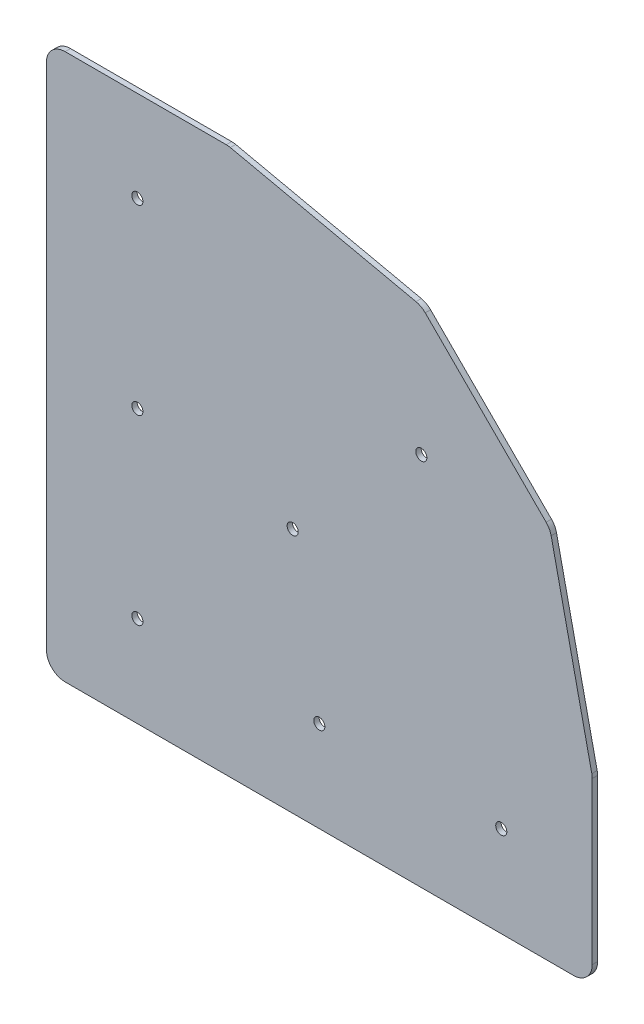
ISO-10303-21;
HEADER;
FILE_DESCRIPTION(('STEP AP214'),'2;1');
FILE_NAME('part.step','',(''),(''),'','','');
FILE_SCHEMA(('AUTOMOTIVE_DESIGN { 1 0 10303 214 1 1 1 1 }'));
ENDSEC;
DATA;
#1=APPLICATION_CONTEXT('core data for automotive mechanical design processes');
#2=APPLICATION_PROTOCOL_DEFINITION('international standard','automotive_design',2000,#1);
#3=PRODUCT_CONTEXT('',#1,'mechanical');
#4=PRODUCT('Part','Part','',(#3));
#5=PRODUCT_RELATED_PRODUCT_CATEGORY('part','',(#4));
#6=PRODUCT_DEFINITION_FORMATION('','',#4);
#7=PRODUCT_DEFINITION_CONTEXT('part definition',#1,'design');
#8=PRODUCT_DEFINITION('design','',#6,#7);
#9=PRODUCT_DEFINITION_SHAPE('','',#8);
#10=(LENGTH_UNIT() NAMED_UNIT(*) SI_UNIT(.MILLI.,.METRE.));
#11=(NAMED_UNIT(*) PLANE_ANGLE_UNIT() SI_UNIT($,.RADIAN.));
#12=(NAMED_UNIT(*) SI_UNIT($,.STERADIAN.) SOLID_ANGLE_UNIT());
#13=UNCERTAINTY_MEASURE_WITH_UNIT(LENGTH_MEASURE(1.E-05),#10,'distance_accuracy_value','');
#14=(GEOMETRIC_REPRESENTATION_CONTEXT(3) GLOBAL_UNCERTAINTY_ASSIGNED_CONTEXT((#13)) GLOBAL_UNIT_ASSIGNED_CONTEXT((#10,
#11,#12)) REPRESENTATION_CONTEXT('',''));
#15=CARTESIAN_POINT('',(0.,0.,0.));
#16=DIRECTION('',(0.,0.,1.));
#17=DIRECTION('',(1.,0.,0.));
#18=AXIS2_PLACEMENT_3D('',#15,#16,#17);
#19=CARTESIAN_POINT('',(156.36875,5.55625,1.5875));
#20=DIRECTION('',(0.,0.,-1.));
#21=DIRECTION('',(-1.,0.,0.));
#22=AXIS2_PLACEMENT_3D('',#19,#20,#21);
#23=CYLINDRICAL_SURFACE('',#22,5.55624999999999);
#24=CARTESIAN_POINT('',(156.36875,5.55625,0.));
#25=DIRECTION('',(0.,0.,-1.));
#26=DIRECTION('',(-1.,0.,0.));
#27=AXIS2_PLACEMENT_3D('',#24,#25,#26);
#28=CIRCLE('',#27,5.55624999999999);
#29=CARTESIAN_POINT('',(161.925,5.55625,0.));
#30=VERTEX_POINT('',#29);
#31=CARTESIAN_POINT('',(156.36875,0.,0.));
#32=VERTEX_POINT('',#31);
#33=EDGE_CURVE('E165',#30,#32,#28,.T.);
#34=ORIENTED_EDGE('',*,*,#33,.F.);
#35=DIRECTION('',(0.,0.,-1.));
#36=VECTOR('',#35,1.);
#37=CARTESIAN_POINT('',(161.925,5.55625,1.5875));
#38=LINE('',#37,#36);
#39=CARTESIAN_POINT('',(161.925,5.55625,1.5875));
#40=VERTEX_POINT('',#39);
#41=EDGE_CURVE('E11',#40,#30,#38,.T.);
#42=ORIENTED_EDGE('',*,*,#41,.F.);
#43=CARTESIAN_POINT('',(156.36875,5.55625,1.5875));
#44=DIRECTION('',(0.,0.,-1.));
#45=DIRECTION('',(-1.,0.,0.));
#46=AXIS2_PLACEMENT_3D('',#43,#44,#45);
#47=CIRCLE('',#46,5.55624999999999);
#48=CARTESIAN_POINT('',(156.36875,0.,1.5875));
#49=VERTEX_POINT('',#48);
#50=EDGE_CURVE('E204',#40,#49,#47,.T.);
#51=ORIENTED_EDGE('',*,*,#50,.T.);
#52=DIRECTION('',(0.,0.,-1.));
#53=VECTOR('',#52,1.);
#54=CARTESIAN_POINT('',(156.36875,0.,1.5875));
#55=LINE('',#54,#53);
#56=EDGE_CURVE('E35',#49,#32,#55,.T.);
#57=ORIENTED_EDGE('',*,*,#56,.T.);
#58=EDGE_LOOP('',(#34,#42,#51,#57));
#59=FACE_BOUND('',#58,.T.);
#60=ADVANCED_FACE('F32',(#59),#23,.T.);
#61=CARTESIAN_POINT('',(161.925,53.3738460334,1.5875));
#62=DIRECTION('',(1.,0.,0.));
#63=DIRECTION('',(0.,1.,0.));
#64=AXIS2_PLACEMENT_3D('',#61,#62,#63);
#65=PLANE('',#64);
#66=DIRECTION('',(0.,-1.,0.));
#67=VECTOR('',#66,1.);
#68=CARTESIAN_POINT('',(161.925,53.3738460334,0.));
#69=LINE('',#68,#67);
#70=CARTESIAN_POINT('',(161.925,53.3738460334,0.));
#71=VERTEX_POINT('',#70);
#72=EDGE_CURVE('E202',#71,#30,#69,.T.);
#73=ORIENTED_EDGE('',*,*,#72,.F.);
#74=DIRECTION('',(0.,0.,-1.));
#75=VECTOR('',#74,1.);
#76=CARTESIAN_POINT('',(161.925,53.3738460334,1.5875));
#77=LINE('',#76,#75);
#78=CARTESIAN_POINT('',(161.925,53.3738460334,1.5875));
#79=VERTEX_POINT('',#78);
#80=EDGE_CURVE('E41',#79,#71,#77,.T.);
#81=ORIENTED_EDGE('',*,*,#80,.F.);
#82=DIRECTION('',(0.,-1.,0.));
#83=VECTOR('',#82,1.);
#84=CARTESIAN_POINT('',(161.925,53.3738460334,1.5875));
#85=LINE('',#84,#83);
#86=EDGE_CURVE('E155',#79,#40,#85,.T.);
#87=ORIENTED_EDGE('',*,*,#86,.T.);
#88=ORIENTED_EDGE('',*,*,#41,.T.);
#89=EDGE_LOOP('',(#73,#81,#87,#88));
#90=FACE_BOUND('',#89,.T.);
#91=ADVANCED_FACE('F228',(#90),#65,.T.);
#92=CARTESIAN_POINT('',(156.368749994601,53.3738460334,1.5875));
#93=DIRECTION('',(0.,0.,-1.));
#94=DIRECTION('',(-1.,0.,0.));
#95=AXIS2_PLACEMENT_3D('',#92,#93,#94);
#96=CYLINDRICAL_SURFACE('',#95,5.55625000539874);
#97=CARTESIAN_POINT('',(156.368749994601,53.3738460334,0.));
#98=DIRECTION('',(0.,0.,-1.));
#99=DIRECTION('',(-1.,0.,0.));
#100=AXIS2_PLACEMENT_3D('',#97,#98,#99);
#101=CIRCLE('',#100,5.55625000539874);
#102=CARTESIAN_POINT('',(161.796422399283,54.5622425959786,0.));
#103=VERTEX_POINT('',#102);
#104=EDGE_CURVE('E142',#103,#71,#101,.T.);
#105=ORIENTED_EDGE('',*,*,#104,.F.);
#106=DIRECTION('',(0.,0.,-1.));
#107=VECTOR('',#106,1.);
#108=CARTESIAN_POINT('',(161.796422399283,54.5622425959786,1.5875));
#109=LINE('',#108,#107);
#110=CARTESIAN_POINT('',(161.796422399283,54.5622425959786,1.5875));
#111=VERTEX_POINT('',#110);
#112=EDGE_CURVE('E137',#111,#103,#109,.T.);
#113=ORIENTED_EDGE('',*,*,#112,.F.);
#114=CARTESIAN_POINT('',(156.368749994601,53.3738460334,1.5875));
#115=DIRECTION('',(0.,0.,-1.));
#116=DIRECTION('',(-1.,0.,0.));
#117=AXIS2_PLACEMENT_3D('',#114,#115,#116);
#118=CIRCLE('',#117,5.55625000539874);
#119=EDGE_CURVE('E140',#111,#79,#118,.T.);
#120=ORIENTED_EDGE('',*,*,#119,.T.);
#121=ORIENTED_EDGE('',*,*,#80,.T.);
#122=EDGE_LOOP('',(#105,#113,#120,#121));
#123=FACE_BOUND('',#122,.T.);
#124=ADVANCED_FACE('F139',(#123),#96,.T.);
#125=CARTESIAN_POINT('',(149.738294564556,109.634404331843,1.5875));
#126=DIRECTION('',(0.976858924527881,0.213884645475622,0.));
#127=DIRECTION('',(-0.213884645475622,0.976858924527881,0.));
#128=AXIS2_PLACEMENT_3D('',#125,#126,#127);
#129=PLANE('',#128);
#130=DIRECTION('',(0.213884645475622,-0.976858924527881,0.));
#131=VECTOR('',#130,1.);
#132=CARTESIAN_POINT('',(149.738294564556,109.634404331843,0.));
#133=LINE('',#132,#131);
#134=CARTESIAN_POINT('',(149.738294564556,109.634404331843,0.));
#135=VERTEX_POINT('',#134);
#136=EDGE_CURVE('E199',#135,#103,#133,.T.);
#137=ORIENTED_EDGE('',*,*,#136,.F.);
#138=DIRECTION('',(0.,0.,-1.));
#139=VECTOR('',#138,1.);
#140=CARTESIAN_POINT('',(149.738294564556,109.634404331843,1.5875));
#141=LINE('',#140,#139);
#142=CARTESIAN_POINT('',(149.738294564556,109.634404331843,1.5875));
#143=VERTEX_POINT('',#142);
#144=EDGE_CURVE('E147',#143,#135,#141,.T.);
#145=ORIENTED_EDGE('',*,*,#144,.F.);
#146=DIRECTION('',(0.213884645475622,-0.976858924527881,0.));
#147=VECTOR('',#146,1.);
#148=CARTESIAN_POINT('',(149.738294564556,109.634404331843,1.5875));
#149=LINE('',#148,#147);
#150=EDGE_CURVE('E153',#143,#111,#149,.T.);
#151=ORIENTED_EDGE('',*,*,#150,.T.);
#152=ORIENTED_EDGE('',*,*,#112,.T.);
#153=EDGE_LOOP('',(#137,#145,#151,#152));
#154=FACE_BOUND('',#153,.T.);
#155=ADVANCED_FACE('F157',(#154),#129,.T.);
#156=CARTESIAN_POINT('',(144.310622161812,108.446007769689,1.5875));
#157=DIRECTION('',(0.,0.,-1.));
#158=DIRECTION('',(-1.,0.,0.));
#159=AXIS2_PLACEMENT_3D('',#156,#157,#158);
#160=CYLINDRICAL_SURFACE('',#159,5.55625000341464);
#161=CARTESIAN_POINT('',(144.310622161812,108.446007769689,0.));
#162=DIRECTION('',(0.,0.,-1.));
#163=DIRECTION('',(-1.,0.,0.));
#164=AXIS2_PLACEMENT_3D('',#161,#162,#163);
#165=CIRCLE('',#164,5.55625000341464);
#166=CARTESIAN_POINT('',(148.239484217194,112.374869825071,0.));
#167=VERTEX_POINT('',#166);
#168=EDGE_CURVE('E196',#167,#135,#165,.T.);
#169=ORIENTED_EDGE('',*,*,#168,.F.);
#170=DIRECTION('',(0.,0.,-1.));
#171=VECTOR('',#170,1.);
#172=CARTESIAN_POINT('',(148.239484217194,112.374869825071,1.5875));
#173=LINE('',#172,#171);
#174=CARTESIAN_POINT('',(148.239484217194,112.374869825071,1.5875));
#175=VERTEX_POINT('',#174);
#176=EDGE_CURVE('E208',#175,#167,#173,.T.);
#177=ORIENTED_EDGE('',*,*,#176,.F.);
#178=CARTESIAN_POINT('',(144.310622161812,108.446007769689,1.5875));
#179=DIRECTION('',(0.,0.,-1.));
#180=DIRECTION('',(-1.,0.,0.));
#181=AXIS2_PLACEMENT_3D('',#178,#179,#180);
#182=CIRCLE('',#181,5.55625000341464);
#183=EDGE_CURVE('E158',#175,#143,#182,.T.);
#184=ORIENTED_EDGE('',*,*,#183,.T.);
#185=ORIENTED_EDGE('',*,*,#144,.T.);
#186=EDGE_LOOP('',(#169,#177,#184,#185));
#187=FACE_BOUND('',#186,.T.);
#188=ADVANCED_FACE('F241',(#187),#160,.T.);
#189=CARTESIAN_POINT('',(112.374869814994,148.239484227271,1.5875));
#190=DIRECTION('',(0.707106781186547,0.707106781186548,0.));
#191=DIRECTION('',(-0.707106781186548,0.707106781186547,0.));
#192=AXIS2_PLACEMENT_3D('',#189,#190,#191);
#193=PLANE('',#192);
#194=DIRECTION('',(0.707106781186548,-0.707106781186547,0.));
#195=VECTOR('',#194,1.);
#196=CARTESIAN_POINT('',(112.374869814994,148.239484227271,0.));
#197=LINE('',#196,#195);
#198=CARTESIAN_POINT('',(112.374869814994,148.239484227271,0.));
#199=VERTEX_POINT('',#198);
#200=EDGE_CURVE('E193',#199,#167,#197,.T.);
#201=ORIENTED_EDGE('',*,*,#200,.F.);
#202=DIRECTION('',(0.,0.,-1.));
#203=VECTOR('',#202,1.);
#204=CARTESIAN_POINT('',(112.374869814994,148.239484227271,1.5875));
#205=LINE('',#204,#203);
#206=CARTESIAN_POINT('',(112.374869814994,148.239484227271,1.5875));
#207=VERTEX_POINT('',#206);
#208=EDGE_CURVE('E210',#207,#199,#205,.T.);
#209=ORIENTED_EDGE('',*,*,#208,.F.);
#210=DIRECTION('',(0.707106781186548,-0.707106781186547,0.));
#211=VECTOR('',#210,1.);
#212=CARTESIAN_POINT('',(112.374869814994,148.239484227271,1.5875));
#213=LINE('',#212,#211);
#214=EDGE_CURVE('E160',#207,#175,#213,.T.);
#215=ORIENTED_EDGE('',*,*,#214,.T.);
#216=ORIENTED_EDGE('',*,*,#176,.T.);
#217=EDGE_LOOP('',(#201,#209,#215,#216));
#218=FACE_BOUND('',#217,.T.);
#219=ADVANCED_FACE('F244',(#218),#193,.T.);
#220=CARTESIAN_POINT('',(108.446007759397,144.310622171673,1.5875));
#221=DIRECTION('',(0.,0.,-1.));
#222=DIRECTION('',(-1.,0.,0.));
#223=AXIS2_PLACEMENT_3D('',#220,#221,#222);
#224=CYLINDRICAL_SURFACE('',#223,5.55625000371919);
#225=CARTESIAN_POINT('',(108.446007759397,144.310622171673,0.));
#226=DIRECTION('',(0.,0.,-1.));
#227=DIRECTION('',(-1.,0.,0.));
#228=AXIS2_PLACEMENT_3D('',#225,#226,#227);
#229=CIRCLE('',#228,5.55625000371919);
#230=CARTESIAN_POINT('',(109.634404320838,149.738294574885,0.));
#231=VERTEX_POINT('',#230);
#232=EDGE_CURVE('E190',#231,#199,#229,.T.);
#233=ORIENTED_EDGE('',*,*,#232,.F.);
#234=DIRECTION('',(0.,0.,-1.));
#235=VECTOR('',#234,1.);
#236=CARTESIAN_POINT('',(109.634404320838,149.738294574885,1.5875));
#237=LINE('',#236,#235);
#238=CARTESIAN_POINT('',(109.634404320838,149.738294574885,1.5875));
#239=VERTEX_POINT('',#238);
#240=EDGE_CURVE('E212',#239,#231,#237,.T.);
#241=ORIENTED_EDGE('',*,*,#240,.F.);
#242=CARTESIAN_POINT('',(108.446007759397,144.310622171673,1.5875));
#243=DIRECTION('',(0.,0.,-1.));
#244=DIRECTION('',(-1.,0.,0.));
#245=AXIS2_PLACEMENT_3D('',#242,#243,#244);
#246=CIRCLE('',#245,5.55625000371919);
#247=EDGE_CURVE('E382',#239,#207,#246,.T.);
#248=ORIENTED_EDGE('',*,*,#247,.T.);
#249=ORIENTED_EDGE('',*,*,#208,.T.);
#250=EDGE_LOOP('',(#233,#241,#248,#249));
#251=FACE_BOUND('',#250,.T.);
#252=ADVANCED_FACE('F248',(#251),#224,.T.);
#253=CARTESIAN_POINT('',(54.5622425832454,161.796422401718,1.5875));
#254=DIRECTION('',(0.213884645335596,0.97685892455854,0.));
#255=DIRECTION('',(-0.97685892455854,0.213884645335596,0.));
#256=AXIS2_PLACEMENT_3D('',#253,#254,#255);
#257=PLANE('',#256);
#258=DIRECTION('',(0.97685892455854,-0.213884645335596,0.));
#259=VECTOR('',#258,1.);
#260=CARTESIAN_POINT('',(54.5622425832454,161.796422401718,0.));
#261=LINE('',#260,#259);
#262=CARTESIAN_POINT('',(54.5622425832454,161.796422401718,0.));
#263=VERTEX_POINT('',#262);
#264=EDGE_CURVE('E187',#263,#231,#261,.T.);
#265=ORIENTED_EDGE('',*,*,#264,.F.);
#266=DIRECTION('',(0.,0.,-1.));
#267=VECTOR('',#266,1.);
#268=CARTESIAN_POINT('',(54.5622425832454,161.796422401718,1.5875));
#269=LINE('',#268,#267);
#270=CARTESIAN_POINT('',(54.5622425832454,161.796422401718,1.5875));
#271=VERTEX_POINT('',#270);
#272=EDGE_CURVE('E214',#271,#263,#269,.T.);
#273=ORIENTED_EDGE('',*,*,#272,.F.);
#274=DIRECTION('',(0.97685892455854,-0.213884645335596,0.));
#275=VECTOR('',#274,1.);
#276=CARTESIAN_POINT('',(54.5622425832454,161.796422401718,1.5875));
#277=LINE('',#276,#275);
#278=EDGE_CURVE('E379',#271,#239,#277,.T.);
#279=ORIENTED_EDGE('',*,*,#278,.T.);
#280=ORIENTED_EDGE('',*,*,#240,.T.);
#281=EDGE_LOOP('',(#265,#273,#279,#280));
#282=FACE_BOUND('',#281,.T.);
#283=ADVANCED_FACE('F252',(#282),#257,.T.);
#284=CARTESIAN_POINT('',(53.3738460220222,156.368749999503,1.5875));
#285=DIRECTION('',(0.,0.,-1.));
#286=DIRECTION('',(-1.,0.,0.));
#287=AXIS2_PLACEMENT_3D('',#284,#285,#286);
#288=CYLINDRICAL_SURFACE('',#287,5.55625000269939);
#289=CARTESIAN_POINT('',(53.3738460220222,156.368749999503,0.));
#290=DIRECTION('',(0.,0.,-1.));
#291=DIRECTION('',(-1.,0.,0.));
#292=AXIS2_PLACEMENT_3D('',#289,#290,#291);
#293=CIRCLE('',#292,5.55625000269939);
#294=CARTESIAN_POINT('',(53.3738460220222,161.925000002202,0.));
#295=VERTEX_POINT('',#294);
#296=EDGE_CURVE('E184',#295,#263,#293,.T.);
#297=ORIENTED_EDGE('',*,*,#296,.F.);
#298=DIRECTION('',(0.,0.,-1.));
#299=VECTOR('',#298,1.);
#300=CARTESIAN_POINT('',(53.3738460220222,161.925000002202,1.5875));
#301=LINE('',#300,#299);
#302=CARTESIAN_POINT('',(53.3738460220222,161.925000002202,1.5875));
#303=VERTEX_POINT('',#302);
#304=EDGE_CURVE('E216',#303,#295,#301,.T.);
#305=ORIENTED_EDGE('',*,*,#304,.F.);
#306=CARTESIAN_POINT('',(53.3738460220222,156.368749999503,1.5875));
#307=DIRECTION('',(0.,0.,-1.));
#308=DIRECTION('',(-1.,0.,0.));
#309=AXIS2_PLACEMENT_3D('',#306,#307,#308);
#310=CIRCLE('',#309,5.55625000269939);
#311=EDGE_CURVE('E376',#303,#271,#310,.T.);
#312=ORIENTED_EDGE('',*,*,#311,.T.);
#313=ORIENTED_EDGE('',*,*,#272,.T.);
#314=EDGE_LOOP('',(#297,#305,#312,#313));
#315=FACE_BOUND('',#314,.T.);
#316=ADVANCED_FACE('F256',(#315),#288,.T.);
#317=CARTESIAN_POINT('',(5.55625000000001,161.925000002202,1.5875));
#318=DIRECTION('',(0.,1.,0.));
#319=DIRECTION('',(0.,0.,1.));
#320=AXIS2_PLACEMENT_3D('',#317,#318,#319);
#321=PLANE('',#320);
#322=DIRECTION('',(1.,0.,0.));
#323=VECTOR('',#322,1.);
#324=CARTESIAN_POINT('',(5.55625000000001,161.925000002202,0.));
#325=LINE('',#324,#323);
#326=CARTESIAN_POINT('',(5.55625000000001,161.925000002202,0.));
#327=VERTEX_POINT('',#326);
#328=EDGE_CURVE('E181',#327,#295,#325,.T.);
#329=ORIENTED_EDGE('',*,*,#328,.F.);
#330=DIRECTION('',(0.,0.,-1.));
#331=VECTOR('',#330,1.);
#332=CARTESIAN_POINT('',(5.55625000000001,161.925000002202,1.5875));
#333=LINE('',#332,#331);
#334=CARTESIAN_POINT('',(5.55625000000001,161.925000002202,1.5875));
#335=VERTEX_POINT('',#334);
#336=EDGE_CURVE('E218',#335,#327,#333,.T.);
#337=ORIENTED_EDGE('',*,*,#336,.F.);
#338=DIRECTION('',(1.,0.,0.));
#339=VECTOR('',#338,1.);
#340=CARTESIAN_POINT('',(5.55625000000001,161.925000002202,1.5875));
#341=LINE('',#340,#339);
#342=EDGE_CURVE('E373',#335,#303,#341,.T.);
#343=ORIENTED_EDGE('',*,*,#342,.T.);
#344=ORIENTED_EDGE('',*,*,#304,.T.);
#345=EDGE_LOOP('',(#329,#337,#343,#344));
#346=FACE_BOUND('',#345,.T.);
#347=ADVANCED_FACE('F260',(#346),#321,.T.);
#348=CARTESIAN_POINT('',(5.55625000000001,156.368750002202,1.5875));
#349=DIRECTION('',(0.,0.,-1.));
#350=DIRECTION('',(-1.,0.,0.));
#351=AXIS2_PLACEMENT_3D('',#348,#349,#350);
#352=CYLINDRICAL_SURFACE('',#351,5.55625000000001);
#353=CARTESIAN_POINT('',(5.55625000000001,156.368750002202,0.));
#354=DIRECTION('',(0.,0.,-1.));
#355=DIRECTION('',(-1.,0.,0.));
#356=AXIS2_PLACEMENT_3D('',#353,#354,#355);
#357=CIRCLE('',#356,5.55625000000001);
#358=CARTESIAN_POINT('',(0.,156.368750002202,0.));
#359=VERTEX_POINT('',#358);
#360=EDGE_CURVE('E178',#359,#327,#357,.T.);
#361=ORIENTED_EDGE('',*,*,#360,.F.);
#362=DIRECTION('',(0.,0.,-1.));
#363=VECTOR('',#362,1.);
#364=CARTESIAN_POINT('',(0.,156.368750002202,1.5875));
#365=LINE('',#364,#363);
#366=CARTESIAN_POINT('',(0.,156.368750002202,1.5875));
#367=VERTEX_POINT('',#366);
#368=EDGE_CURVE('E220',#367,#359,#365,.T.);
#369=ORIENTED_EDGE('',*,*,#368,.F.);
#370=CARTESIAN_POINT('',(5.55625000000001,156.368750002202,1.5875));
#371=DIRECTION('',(0.,0.,-1.));
#372=DIRECTION('',(-1.,0.,0.));
#373=AXIS2_PLACEMENT_3D('',#370,#371,#372);
#374=CIRCLE('',#373,5.55625000000001);
#375=EDGE_CURVE('E370',#367,#335,#374,.T.);
#376=ORIENTED_EDGE('',*,*,#375,.T.);
#377=ORIENTED_EDGE('',*,*,#336,.T.);
#378=EDGE_LOOP('',(#361,#369,#376,#377));
#379=FACE_BOUND('',#378,.T.);
#380=ADVANCED_FACE('F264',(#379),#352,.T.);
#381=CARTESIAN_POINT('',(0.,5.55625000000001,1.5875));
#382=DIRECTION('',(-1.,0.,0.));
#383=DIRECTION('',(0.,0.,1.));
#384=AXIS2_PLACEMENT_3D('',#381,#382,#383);
#385=PLANE('',#384);
#386=DIRECTION('',(0.,1.,0.));
#387=VECTOR('',#386,1.);
#388=CARTESIAN_POINT('',(0.,5.55625000000001,0.));
#389=LINE('',#388,#387);
#390=CARTESIAN_POINT('',(0.,5.55625000000001,0.));
#391=VERTEX_POINT('',#390);
#392=EDGE_CURVE('E175',#391,#359,#389,.T.);
#393=ORIENTED_EDGE('',*,*,#392,.F.);
#394=DIRECTION('',(0.,0.,-1.));
#395=VECTOR('',#394,1.);
#396=CARTESIAN_POINT('',(0.,5.55625000000001,1.5875));
#397=LINE('',#396,#395);
#398=CARTESIAN_POINT('',(0.,5.55625000000001,1.5875));
#399=VERTEX_POINT('',#398);
#400=EDGE_CURVE('E222',#399,#391,#397,.T.);
#401=ORIENTED_EDGE('',*,*,#400,.F.);
#402=DIRECTION('',(0.,1.,0.));
#403=VECTOR('',#402,1.);
#404=CARTESIAN_POINT('',(0.,5.55625000000001,1.5875));
#405=LINE('',#404,#403);
#406=EDGE_CURVE('E367',#399,#367,#405,.T.);
#407=ORIENTED_EDGE('',*,*,#406,.T.);
#408=ORIENTED_EDGE('',*,*,#368,.T.);
#409=EDGE_LOOP('',(#393,#401,#407,#408));
#410=FACE_BOUND('',#409,.T.);
#411=ADVANCED_FACE('F268',(#410),#385,.T.);
#412=CARTESIAN_POINT('',(5.55625,5.55625,1.5875));
#413=DIRECTION('',(0.,0.,-1.));
#414=DIRECTION('',(-1.,0.,0.));
#415=AXIS2_PLACEMENT_3D('',#412,#413,#414);
#416=CYLINDRICAL_SURFACE('',#415,5.55625);
#417=CARTESIAN_POINT('',(5.55625,5.55625,0.));
#418=DIRECTION('',(0.,0.,-1.));
#419=DIRECTION('',(-1.,0.,0.));
#420=AXIS2_PLACEMENT_3D('',#417,#418,#419);
#421=CIRCLE('',#420,5.55625);
#422=CARTESIAN_POINT('',(5.55625,0.,0.));
#423=VERTEX_POINT('',#422);
#424=EDGE_CURVE('E172',#423,#391,#421,.T.);
#425=ORIENTED_EDGE('',*,*,#424,.F.);
#426=DIRECTION('',(0.,0.,-1.));
#427=VECTOR('',#426,1.);
#428=CARTESIAN_POINT('',(5.55625,0.,1.5875));
#429=LINE('',#428,#427);
#430=CARTESIAN_POINT('',(5.55625,0.,1.5875));
#431=VERTEX_POINT('',#430);
#432=EDGE_CURVE('E223',#431,#423,#429,.T.);
#433=ORIENTED_EDGE('',*,*,#432,.F.);
#434=CARTESIAN_POINT('',(5.55625,5.55625,1.5875));
#435=DIRECTION('',(0.,0.,-1.));
#436=DIRECTION('',(-1.,0.,0.));
#437=AXIS2_PLACEMENT_3D('',#434,#435,#436);
#438=CIRCLE('',#437,5.55625);
#439=EDGE_CURVE('E364',#431,#399,#438,.T.);
#440=ORIENTED_EDGE('',*,*,#439,.T.);
#441=ORIENTED_EDGE('',*,*,#400,.T.);
#442=EDGE_LOOP('',(#425,#433,#440,#441));
#443=FACE_BOUND('',#442,.T.);
#444=ADVANCED_FACE('F272',(#443),#416,.T.);
#445=CARTESIAN_POINT('',(156.36875,0.,1.5875));
#446=DIRECTION('',(0.,-1.,0.));
#447=DIRECTION('',(0.,0.,-1.));
#448=AXIS2_PLACEMENT_3D('',#445,#446,#447);
#449=PLANE('',#448);
#450=DIRECTION('',(-1.,0.,0.));
#451=VECTOR('',#450,1.);
#452=CARTESIAN_POINT('',(156.36875,0.,0.));
#453=LINE('',#452,#451);
#454=EDGE_CURVE('E168',#32,#423,#453,.T.);
#455=ORIENTED_EDGE('',*,*,#454,.F.);
#456=ORIENTED_EDGE('',*,*,#56,.F.);
#457=DIRECTION('',(-1.,0.,0.));
#458=VECTOR('',#457,1.);
#459=CARTESIAN_POINT('',(156.36875,0.,1.5875));
#460=LINE('',#459,#458);
#461=EDGE_CURVE('E362',#49,#431,#460,.T.);
#462=ORIENTED_EDGE('',*,*,#461,.T.);
#463=ORIENTED_EDGE('',*,*,#432,.T.);
#464=EDGE_LOOP('',(#455,#456,#462,#463));
#465=FACE_BOUND('',#464,.T.);
#466=ADVANCED_FACE('F225',(#465),#449,.T.);
#467=CARTESIAN_POINT('',(156.36875,5.55625,1.5875));
#468=DIRECTION('',(0.,0.,-1.));
#469=DIRECTION('',(-1.,0.,0.));
#470=AXIS2_PLACEMENT_3D('',#467,#468,#469);
#471=PLANE('',#470);
#472=CARTESIAN_POINT('',(80.9625,26.9875,1.5875));
#473=DIRECTION('',(0.,0.,-1.));
#474=DIRECTION('',(1.,0.,0.));
#475=AXIS2_PLACEMENT_3D('',#472,#473,#474);
#476=CIRCLE('',#475,1.65099999999999);
#477=CARTESIAN_POINT('',(82.6135,26.9875,1.5875));
#478=VERTEX_POINT('',#477);
#479=EDGE_CURVE('E319',#478,#478,#476,.T.);
#480=ORIENTED_EDGE('',*,*,#479,.T.);
#481=EDGE_LOOP('',(#480));
#482=FACE_BOUND('',#481,.T.);
#483=CARTESIAN_POINT('',(111.224132771,111.224132771,1.5875));
#484=DIRECTION('',(0.,0.,-1.));
#485=DIRECTION('',(1.,0.,0.));
#486=AXIS2_PLACEMENT_3D('',#483,#484,#485);
#487=CIRCLE('',#486,1.65100000000001);
#488=CARTESIAN_POINT('',(112.875132771,111.224132771,1.5875));
#489=VERTEX_POINT('',#488);
#490=EDGE_CURVE('E327',#489,#489,#487,.T.);
#491=ORIENTED_EDGE('',*,*,#490,.T.);
#492=EDGE_LOOP('',(#491));
#493=FACE_BOUND('',#492,.T.);
#494=CARTESIAN_POINT('',(73.058044257,73.058044257,1.5875));
#495=DIRECTION('',(0.,0.,-1.));
#496=DIRECTION('',(1.,0.,0.));
#497=AXIS2_PLACEMENT_3D('',#494,#495,#496);
#498=CIRCLE('',#497,1.65100000000001);
#499=CARTESIAN_POINT('',(74.709044257,73.058044257,1.5875));
#500=VERTEX_POINT('',#499);
#501=EDGE_CURVE('E333',#500,#500,#498,.T.);
#502=ORIENTED_EDGE('',*,*,#501,.T.);
#503=EDGE_LOOP('',(#502));
#504=FACE_BOUND('',#503,.T.);
#505=CARTESIAN_POINT('',(134.9375,26.9875,1.5875));
#506=DIRECTION('',(0.,0.,-1.));
#507=DIRECTION('',(1.,0.,0.));
#508=AXIS2_PLACEMENT_3D('',#505,#506,#507);
#509=CIRCLE('',#508,1.65100000000001);
#510=CARTESIAN_POINT('',(136.5885,26.9875,1.5875));
#511=VERTEX_POINT('',#510);
#512=EDGE_CURVE('E339',#511,#511,#509,.T.);
#513=ORIENTED_EDGE('',*,*,#512,.T.);
#514=EDGE_LOOP('',(#513));
#515=FACE_BOUND('',#514,.T.);
#516=CARTESIAN_POINT('',(26.9875,26.9875,1.5875));
#517=DIRECTION('',(0.,0.,-1.));
#518=DIRECTION('',(1.,0.,0.));
#519=AXIS2_PLACEMENT_3D('',#516,#517,#518);
#520=CIRCLE('',#519,1.651);
#521=CARTESIAN_POINT('',(28.6385,26.9875,1.5875));
#522=VERTEX_POINT('',#521);
#523=EDGE_CURVE('E345',#522,#522,#520,.T.);
#524=ORIENTED_EDGE('',*,*,#523,.T.);
#525=EDGE_LOOP('',(#524));
#526=FACE_BOUND('',#525,.T.);
#527=CARTESIAN_POINT('',(26.9875,80.9625,1.5875));
#528=DIRECTION('',(0.,0.,-1.));
#529=DIRECTION('',(1.,0.,0.));
#530=AXIS2_PLACEMENT_3D('',#527,#528,#529);
#531=CIRCLE('',#530,1.651);
#532=CARTESIAN_POINT('',(28.6385,80.9625,1.5875));
#533=VERTEX_POINT('',#532);
#534=EDGE_CURVE('E351',#533,#533,#531,.T.);
#535=ORIENTED_EDGE('',*,*,#534,.T.);
#536=EDGE_LOOP('',(#535));
#537=FACE_BOUND('',#536,.T.);
#538=CARTESIAN_POINT('',(26.9875,134.9375,1.5875));
#539=DIRECTION('',(0.,0.,-1.));
#540=DIRECTION('',(1.,0.,0.));
#541=AXIS2_PLACEMENT_3D('',#538,#539,#540);
#542=CIRCLE('',#541,1.651);
#543=CARTESIAN_POINT('',(28.6385,134.9375,1.5875));
#544=VERTEX_POINT('',#543);
#545=EDGE_CURVE('E169',#544,#544,#542,.T.);
#546=ORIENTED_EDGE('',*,*,#545,.T.);
#547=EDGE_LOOP('',(#546));
#548=FACE_BOUND('',#547,.T.);
#549=ORIENTED_EDGE('',*,*,#50,.F.);
#550=ORIENTED_EDGE('',*,*,#86,.F.);
#551=ORIENTED_EDGE('',*,*,#119,.F.);
#552=ORIENTED_EDGE('',*,*,#150,.F.);
#553=ORIENTED_EDGE('',*,*,#183,.F.);
#554=ORIENTED_EDGE('',*,*,#214,.F.);
#555=ORIENTED_EDGE('',*,*,#247,.F.);
#556=ORIENTED_EDGE('',*,*,#278,.F.);
#557=ORIENTED_EDGE('',*,*,#311,.F.);
#558=ORIENTED_EDGE('',*,*,#342,.F.);
#559=ORIENTED_EDGE('',*,*,#375,.F.);
#560=ORIENTED_EDGE('',*,*,#406,.F.);
#561=ORIENTED_EDGE('',*,*,#439,.F.);
#562=ORIENTED_EDGE('',*,*,#461,.F.);
#563=EDGE_LOOP('',(#549,#550,#551,#552,#553,#554,#555,#556,#557,#558,#559,#560,#561,#562));
#564=FACE_BOUND('',#563,.T.);
#565=ADVANCED_FACE('F151',(#482,#493,#504,#515,#526,#537,#548,#564),#471,.F.);
#566=CARTESIAN_POINT('',(156.36875,5.55625,0.));
#567=DIRECTION('',(0.,0.,-1.));
#568=DIRECTION('',(-1.,0.,0.));
#569=AXIS2_PLACEMENT_3D('',#566,#567,#568);
#570=PLANE('',#569);
#571=CARTESIAN_POINT('',(80.9625,26.9875,0.));
#572=DIRECTION('',(0.,0.,-1.));
#573=DIRECTION('',(1.,0.,0.));
#574=AXIS2_PLACEMENT_3D('',#571,#572,#573);
#575=CIRCLE('',#574,1.65099999999999);
#576=CARTESIAN_POINT('',(82.6135,26.9875,0.));
#577=VERTEX_POINT('',#576);
#578=EDGE_CURVE('E322',#577,#577,#575,.T.);
#579=ORIENTED_EDGE('',*,*,#578,.F.);
#580=EDGE_LOOP('',(#579));
#581=FACE_BOUND('',#580,.T.);
#582=CARTESIAN_POINT('',(111.224132771,111.224132771,0.));
#583=DIRECTION('',(0.,0.,-1.));
#584=DIRECTION('',(1.,0.,0.));
#585=AXIS2_PLACEMENT_3D('',#582,#583,#584);
#586=CIRCLE('',#585,1.65100000000001);
#587=CARTESIAN_POINT('',(112.875132771,111.224132771,0.));
#588=VERTEX_POINT('',#587);
#589=EDGE_CURVE('E324',#588,#588,#586,.T.);
#590=ORIENTED_EDGE('',*,*,#589,.F.);
#591=EDGE_LOOP('',(#590));
#592=FACE_BOUND('',#591,.T.);
#593=CARTESIAN_POINT('',(73.058044257,73.058044257,0.));
#594=DIRECTION('',(0.,0.,-1.));
#595=DIRECTION('',(1.,0.,0.));
#596=AXIS2_PLACEMENT_3D('',#593,#594,#595);
#597=CIRCLE('',#596,1.65100000000001);
#598=CARTESIAN_POINT('',(74.709044257,73.058044257,0.));
#599=VERTEX_POINT('',#598);
#600=EDGE_CURVE('E330',#599,#599,#597,.T.);
#601=ORIENTED_EDGE('',*,*,#600,.F.);
#602=EDGE_LOOP('',(#601));
#603=FACE_BOUND('',#602,.T.);
#604=CARTESIAN_POINT('',(134.9375,26.9875,0.));
#605=DIRECTION('',(0.,0.,-1.));
#606=DIRECTION('',(1.,0.,0.));
#607=AXIS2_PLACEMENT_3D('',#604,#605,#606);
#608=CIRCLE('',#607,1.65100000000001);
#609=CARTESIAN_POINT('',(136.5885,26.9875,0.));
#610=VERTEX_POINT('',#609);
#611=EDGE_CURVE('E336',#610,#610,#608,.T.);
#612=ORIENTED_EDGE('',*,*,#611,.F.);
#613=EDGE_LOOP('',(#612));
#614=FACE_BOUND('',#613,.T.);
#615=CARTESIAN_POINT('',(26.9875,26.9875,0.));
#616=DIRECTION('',(0.,0.,-1.));
#617=DIRECTION('',(1.,0.,0.));
#618=AXIS2_PLACEMENT_3D('',#615,#616,#617);
#619=CIRCLE('',#618,1.651);
#620=CARTESIAN_POINT('',(28.6385,26.9875,0.));
#621=VERTEX_POINT('',#620);
#622=EDGE_CURVE('E342',#621,#621,#619,.T.);
#623=ORIENTED_EDGE('',*,*,#622,.F.);
#624=EDGE_LOOP('',(#623));
#625=FACE_BOUND('',#624,.T.);
#626=CARTESIAN_POINT('',(26.9875,80.9625,0.));
#627=DIRECTION('',(0.,0.,-1.));
#628=DIRECTION('',(1.,0.,0.));
#629=AXIS2_PLACEMENT_3D('',#626,#627,#628);
#630=CIRCLE('',#629,1.651);
#631=CARTESIAN_POINT('',(28.6385,80.9625,0.));
#632=VERTEX_POINT('',#631);
#633=EDGE_CURVE('E348',#632,#632,#630,.T.);
#634=ORIENTED_EDGE('',*,*,#633,.F.);
#635=EDGE_LOOP('',(#634));
#636=FACE_BOUND('',#635,.T.);
#637=CARTESIAN_POINT('',(26.9875,134.9375,0.));
#638=DIRECTION('',(0.,0.,-1.));
#639=DIRECTION('',(1.,0.,0.));
#640=AXIS2_PLACEMENT_3D('',#637,#638,#639);
#641=CIRCLE('',#640,1.651);
#642=CARTESIAN_POINT('',(28.6385,134.9375,0.));
#643=VERTEX_POINT('',#642);
#644=EDGE_CURVE('E354',#643,#643,#641,.T.);
#645=ORIENTED_EDGE('',*,*,#644,.F.);
#646=EDGE_LOOP('',(#645));
#647=FACE_BOUND('',#646,.T.);
#648=ORIENTED_EDGE('',*,*,#33,.T.);
#649=ORIENTED_EDGE('',*,*,#454,.T.);
#650=ORIENTED_EDGE('',*,*,#424,.T.);
#651=ORIENTED_EDGE('',*,*,#392,.T.);
#652=ORIENTED_EDGE('',*,*,#360,.T.);
#653=ORIENTED_EDGE('',*,*,#328,.T.);
#654=ORIENTED_EDGE('',*,*,#296,.T.);
#655=ORIENTED_EDGE('',*,*,#264,.T.);
#656=ORIENTED_EDGE('',*,*,#232,.T.);
#657=ORIENTED_EDGE('',*,*,#200,.T.);
#658=ORIENTED_EDGE('',*,*,#168,.T.);
#659=ORIENTED_EDGE('',*,*,#136,.T.);
#660=ORIENTED_EDGE('',*,*,#104,.T.);
#661=ORIENTED_EDGE('',*,*,#72,.T.);
#662=EDGE_LOOP('',(#648,#649,#650,#651,#652,#653,#654,#655,#656,#657,#658,#659,#660,#661));
#663=FACE_BOUND('',#662,.T.);
#664=ADVANCED_FACE('F227',(#581,#592,#603,#614,#625,#636,#647,#663),#570,.T.);
#665=CARTESIAN_POINT('',(26.9875,134.9375,1.5875));
#666=DIRECTION('',(0.,0.,-1.));
#667=DIRECTION('',(-1.,0.,0.));
#668=AXIS2_PLACEMENT_3D('',#665,#666,#667);
#669=CYLINDRICAL_SURFACE('',#668,1.651);
#670=ORIENTED_EDGE('',*,*,#545,.F.);
#671=EDGE_LOOP('',(#670));
#672=FACE_BOUND('',#671,.T.);
#673=ORIENTED_EDGE('',*,*,#644,.T.);
#674=EDGE_LOOP('',(#673));
#675=FACE_BOUND('',#674,.T.);
#676=ADVANCED_FACE('F284',(#672,#675),#669,.F.);
#677=CARTESIAN_POINT('',(26.9875,80.9625,1.5875));
#678=DIRECTION('',(0.,0.,-1.));
#679=DIRECTION('',(-1.,0.,0.));
#680=AXIS2_PLACEMENT_3D('',#677,#678,#679);
#681=CYLINDRICAL_SURFACE('',#680,1.651);
#682=ORIENTED_EDGE('',*,*,#534,.F.);
#683=EDGE_LOOP('',(#682));
#684=FACE_BOUND('',#683,.T.);
#685=ORIENTED_EDGE('',*,*,#633,.T.);
#686=EDGE_LOOP('',(#685));
#687=FACE_BOUND('',#686,.T.);
#688=ADVANCED_FACE('F291',(#684,#687),#681,.F.);
#689=CARTESIAN_POINT('',(26.9875,26.9875,1.5875));
#690=DIRECTION('',(0.,0.,-1.));
#691=DIRECTION('',(-1.,0.,0.));
#692=AXIS2_PLACEMENT_3D('',#689,#690,#691);
#693=CYLINDRICAL_SURFACE('',#692,1.651);
#694=ORIENTED_EDGE('',*,*,#523,.F.);
#695=EDGE_LOOP('',(#694));
#696=FACE_BOUND('',#695,.T.);
#697=ORIENTED_EDGE('',*,*,#622,.T.);
#698=EDGE_LOOP('',(#697));
#699=FACE_BOUND('',#698,.T.);
#700=ADVANCED_FACE('F295',(#696,#699),#693,.F.);
#701=CARTESIAN_POINT('',(134.9375,26.9875,1.5875));
#702=DIRECTION('',(0.,0.,-1.));
#703=DIRECTION('',(-1.,0.,0.));
#704=AXIS2_PLACEMENT_3D('',#701,#702,#703);
#705=CYLINDRICAL_SURFACE('',#704,1.65100000000001);
#706=ORIENTED_EDGE('',*,*,#512,.F.);
#707=EDGE_LOOP('',(#706));
#708=FACE_BOUND('',#707,.T.);
#709=ORIENTED_EDGE('',*,*,#611,.T.);
#710=EDGE_LOOP('',(#709));
#711=FACE_BOUND('',#710,.T.);
#712=ADVANCED_FACE('F299',(#708,#711),#705,.F.);
#713=CARTESIAN_POINT('',(73.058044257,73.058044257,1.5875));
#714=DIRECTION('',(0.,0.,-1.));
#715=DIRECTION('',(-1.,0.,0.));
#716=AXIS2_PLACEMENT_3D('',#713,#714,#715);
#717=CYLINDRICAL_SURFACE('',#716,1.65100000000001);
#718=ORIENTED_EDGE('',*,*,#501,.F.);
#719=EDGE_LOOP('',(#718));
#720=FACE_BOUND('',#719,.T.);
#721=ORIENTED_EDGE('',*,*,#600,.T.);
#722=EDGE_LOOP('',(#721));
#723=FACE_BOUND('',#722,.T.);
#724=ADVANCED_FACE('F303',(#720,#723),#717,.F.);
#725=CARTESIAN_POINT('',(111.224132771,111.224132771,1.5875));
#726=DIRECTION('',(0.,0.,-1.));
#727=DIRECTION('',(-1.,0.,0.));
#728=AXIS2_PLACEMENT_3D('',#725,#726,#727);
#729=CYLINDRICAL_SURFACE('',#728,1.65100000000001);
#730=ORIENTED_EDGE('',*,*,#490,.F.);
#731=EDGE_LOOP('',(#730));
#732=FACE_BOUND('',#731,.T.);
#733=ORIENTED_EDGE('',*,*,#589,.T.);
#734=EDGE_LOOP('',(#733));
#735=FACE_BOUND('',#734,.T.);
#736=ADVANCED_FACE('F307',(#732,#735),#729,.F.);
#737=CARTESIAN_POINT('',(80.9625,26.9875,1.5875));
#738=DIRECTION('',(0.,0.,-1.));
#739=DIRECTION('',(-1.,0.,0.));
#740=AXIS2_PLACEMENT_3D('',#737,#738,#739);
#741=CYLINDRICAL_SURFACE('',#740,1.65099999999999);
#742=ORIENTED_EDGE('',*,*,#479,.F.);
#743=EDGE_LOOP('',(#742));
#744=FACE_BOUND('',#743,.T.);
#745=ORIENTED_EDGE('',*,*,#578,.T.);
#746=EDGE_LOOP('',(#745));
#747=FACE_BOUND('',#746,.T.);
#748=ADVANCED_FACE('F311',(#744,#747),#741,.F.);
#749=CLOSED_SHELL('',(#60,#91,#124,#155,#188,#219,#252,#283,#316,#347,#380,#411,#444,#466,#565,
#664,#676,#688,#700,#712,#724,#736,#748));
#750=MANIFOLD_SOLID_BREP('B2',#749);
#751=ADVANCED_BREP_SHAPE_REPRESENTATION('',(#18,#750),#14);
#752=SHAPE_DEFINITION_REPRESENTATION(#9,#751);
ENDSEC;
END-ISO-10303-21;
